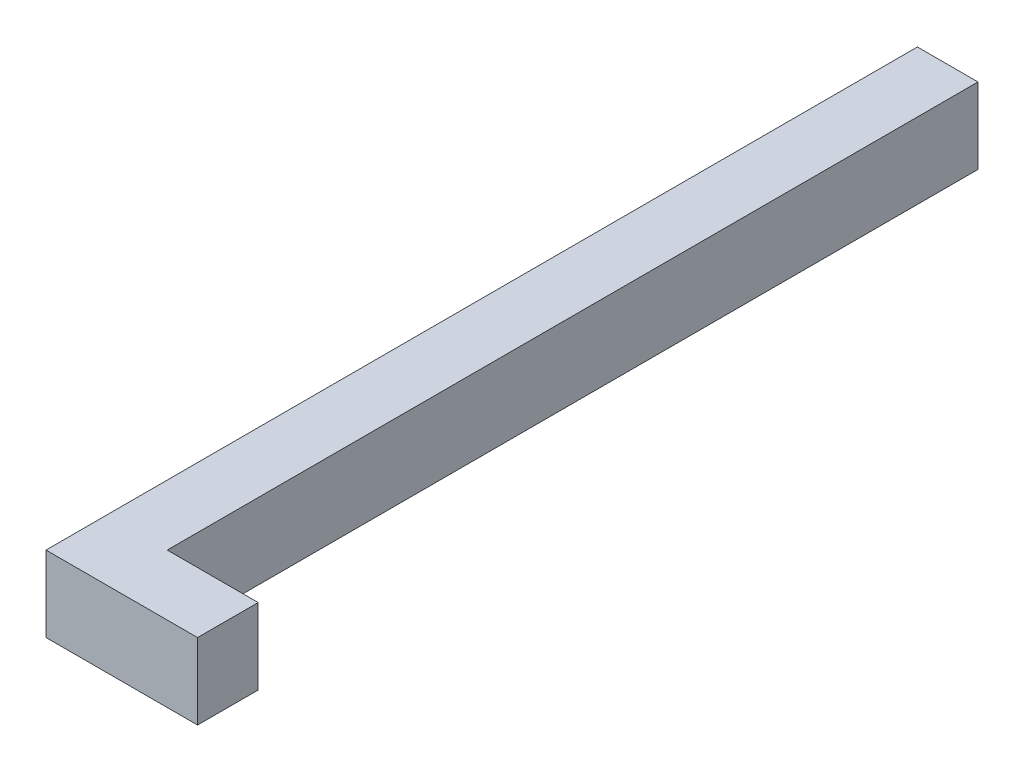
ISO-10303-21;
HEADER;
FILE_DESCRIPTION(('STEP AP214'),'2;1');
FILE_NAME('part.step','',(''),(''),'','','');
FILE_SCHEMA(('AUTOMOTIVE_DESIGN { 1 0 10303 214 1 1 1 1 }'));
ENDSEC;
DATA;
#1=APPLICATION_CONTEXT('core data for automotive mechanical design processes');
#2=APPLICATION_PROTOCOL_DEFINITION('international standard','automotive_design',2000,#1);
#3=PRODUCT_CONTEXT('',#1,'mechanical');
#4=PRODUCT('Part','Part','',(#3));
#5=PRODUCT_RELATED_PRODUCT_CATEGORY('part','',(#4));
#6=PRODUCT_DEFINITION_FORMATION('','',#4);
#7=PRODUCT_DEFINITION_CONTEXT('part definition',#1,'design');
#8=PRODUCT_DEFINITION('design','',#6,#7);
#9=PRODUCT_DEFINITION_SHAPE('','',#8);
#10=(LENGTH_UNIT() NAMED_UNIT(*) SI_UNIT(.MILLI.,.METRE.));
#11=(NAMED_UNIT(*) PLANE_ANGLE_UNIT() SI_UNIT($,.RADIAN.));
#12=(NAMED_UNIT(*) SI_UNIT($,.STERADIAN.) SOLID_ANGLE_UNIT());
#13=UNCERTAINTY_MEASURE_WITH_UNIT(LENGTH_MEASURE(1.E-05),#10,'distance_accuracy_value','');
#14=(GEOMETRIC_REPRESENTATION_CONTEXT(3) GLOBAL_UNCERTAINTY_ASSIGNED_CONTEXT((#13)) GLOBAL_UNIT_ASSIGNED_CONTEXT((#10,
#11,#12)) REPRESENTATION_CONTEXT('',''));
#15=CARTESIAN_POINT('',(0.,0.,0.));
#16=DIRECTION('',(0.,0.,1.));
#17=DIRECTION('',(1.,0.,0.));
#18=AXIS2_PLACEMENT_3D('',#15,#16,#17);
#19=CARTESIAN_POINT('',(8.,0.,115.));
#20=DIRECTION('',(-1.,0.,0.));
#21=DIRECTION('',(0.,0.,1.));
#22=AXIS2_PLACEMENT_3D('',#19,#20,#21);
#23=PLANE('',#22);
#24=DIRECTION('',(0.,1.,0.));
#25=VECTOR('',#24,1.);
#26=CARTESIAN_POINT('',(8.,0.,107.));
#27=LINE('',#26,#25);
#28=CARTESIAN_POINT('',(8.,0.,107.));
#29=VERTEX_POINT('',#28);
#30=CARTESIAN_POINT('',(8.,10.,107.));
#31=VERTEX_POINT('',#30);
#32=EDGE_CURVE('E48',#29,#31,#27,.T.);
#33=ORIENTED_EDGE('',*,*,#32,.F.);
#34=DIRECTION('',(0.,0.,-1.));
#35=VECTOR('',#34,1.);
#36=CARTESIAN_POINT('',(8.,0.,115.));
#37=LINE('',#36,#35);
#38=CARTESIAN_POINT('',(8.,0.,0.));
#39=VERTEX_POINT('',#38);
#40=EDGE_CURVE('E41',#29,#39,#37,.T.);
#41=ORIENTED_EDGE('',*,*,#40,.T.);
#42=DIRECTION('',(0.,1.,0.));
#43=VECTOR('',#42,1.);
#44=CARTESIAN_POINT('',(8.,0.,0.));
#45=LINE('',#44,#43);
#46=CARTESIAN_POINT('',(8.,10.,0.));
#47=VERTEX_POINT('',#46);
#48=EDGE_CURVE('E187',#39,#47,#45,.T.);
#49=ORIENTED_EDGE('',*,*,#48,.T.);
#50=DIRECTION('',(0.,0.,-1.));
#51=VECTOR('',#50,1.);
#52=CARTESIAN_POINT('',(8.,10.,115.));
#53=LINE('',#52,#51);
#54=EDGE_CURVE('E193',#31,#47,#53,.T.);
#55=ORIENTED_EDGE('',*,*,#54,.F.);
#56=EDGE_LOOP('',(#33,#41,#49,#55));
#57=FACE_BOUND('',#56,.T.);
#58=ADVANCED_FACE('F33',(#57),#23,.F.);
#59=CARTESIAN_POINT('',(0.,0.,115.));
#60=DIRECTION('',(1.,0.,0.));
#61=DIRECTION('',(0.,0.,-1.));
#62=AXIS2_PLACEMENT_3D('',#59,#60,#61);
#63=PLANE('',#62);
#64=CARTESIAN_POINT('',(0.,5.,30.));
#65=DIRECTION('',(-1.,0.,0.));
#66=DIRECTION('',(0.,0.,1.));
#67=AXIS2_PLACEMENT_3D('',#64,#65,#66);
#68=CIRCLE('',#67,2.6);
#69=CARTESIAN_POINT('',(0.,5.,32.6));
#70=VERTEX_POINT('',#69);
#71=EDGE_CURVE('E139',#70,#70,#68,.T.);
#72=ORIENTED_EDGE('',*,*,#71,.F.);
#73=EDGE_LOOP('',(#72));
#74=FACE_BOUND('',#73,.T.);
#75=DIRECTION('',(0.,-1.,0.));
#76=VECTOR('',#75,1.);
#77=CARTESIAN_POINT('',(0.,0.,0.));
#78=LINE('',#77,#76);
#79=CARTESIAN_POINT('',(0.,10.,0.));
#80=VERTEX_POINT('',#79);
#81=CARTESIAN_POINT('',(0.,0.,0.));
#82=VERTEX_POINT('',#81);
#83=EDGE_CURVE('E178',#80,#82,#78,.T.);
#84=ORIENTED_EDGE('',*,*,#83,.T.);
#85=DIRECTION('',(0.,0.,-1.));
#86=VECTOR('',#85,1.);
#87=CARTESIAN_POINT('',(0.,0.,115.));
#88=LINE('',#87,#86);
#89=CARTESIAN_POINT('',(0.,0.,115.));
#90=VERTEX_POINT('',#89);
#91=EDGE_CURVE('E11',#90,#82,#88,.T.);
#92=ORIENTED_EDGE('',*,*,#91,.F.);
#93=DIRECTION('',(0.,-1.,0.));
#94=VECTOR('',#93,1.);
#95=CARTESIAN_POINT('',(0.,0.,115.));
#96=LINE('',#95,#94);
#97=CARTESIAN_POINT('',(0.,10.,115.));
#98=VERTEX_POINT('',#97);
#99=EDGE_CURVE('E116',#98,#90,#96,.T.);
#100=ORIENTED_EDGE('',*,*,#99,.F.);
#101=DIRECTION('',(0.,0.,-1.));
#102=VECTOR('',#101,1.);
#103=CARTESIAN_POINT('',(0.,10.,115.));
#104=LINE('',#103,#102);
#105=EDGE_CURVE('E182',#98,#80,#104,.T.);
#106=ORIENTED_EDGE('',*,*,#105,.T.);
#107=EDGE_LOOP('',(#84,#92,#100,#106));
#108=FACE_BOUND('',#107,.T.);
#109=ADVANCED_FACE('F35',(#74,#108),#63,.F.);
#110=CARTESIAN_POINT('',(0.,0.,115.));
#111=DIRECTION('',(0.,1.,0.));
#112=DIRECTION('',(0.,0.,1.));
#113=AXIS2_PLACEMENT_3D('',#110,#111,#112);
#114=PLANE('',#113);
#115=DIRECTION('',(1.,0.,0.));
#116=VECTOR('',#115,1.);
#117=CARTESIAN_POINT('',(0.,0.,0.));
#118=LINE('',#117,#116);
#119=EDGE_CURVE('E185',#82,#39,#118,.T.);
#120=ORIENTED_EDGE('',*,*,#119,.T.);
#121=ORIENTED_EDGE('',*,*,#40,.F.);
#122=DIRECTION('',(-1.,0.,0.));
#123=VECTOR('',#122,1.);
#124=CARTESIAN_POINT('',(20.,0.,107.));
#125=LINE('',#124,#123);
#126=CARTESIAN_POINT('',(20.,0.,107.));
#127=VERTEX_POINT('',#126);
#128=EDGE_CURVE('E126',#127,#29,#125,.T.);
#129=ORIENTED_EDGE('',*,*,#128,.F.);
#130=DIRECTION('',(0.,0.,-1.));
#131=VECTOR('',#130,1.);
#132=CARTESIAN_POINT('',(20.,0.,115.));
#133=LINE('',#132,#131);
#134=CARTESIAN_POINT('',(20.,0.,115.));
#135=VERTEX_POINT('',#134);
#136=EDGE_CURVE('E122',#135,#127,#133,.T.);
#137=ORIENTED_EDGE('',*,*,#136,.F.);
#138=DIRECTION('',(1.,0.,0.));
#139=VECTOR('',#138,1.);
#140=CARTESIAN_POINT('',(0.,0.,115.));
#141=LINE('',#140,#139);
#142=EDGE_CURVE('E110',#90,#135,#141,.T.);
#143=ORIENTED_EDGE('',*,*,#142,.F.);
#144=ORIENTED_EDGE('',*,*,#91,.T.);
#145=EDGE_LOOP('',(#120,#121,#129,#137,#143,#144));
#146=FACE_BOUND('',#145,.T.);
#147=ADVANCED_FACE('F124',(#146),#114,.F.);
#148=CARTESIAN_POINT('',(0.,10.,115.));
#149=DIRECTION('',(0.,-1.,0.));
#150=DIRECTION('',(0.,0.,-1.));
#151=AXIS2_PLACEMENT_3D('',#148,#149,#150);
#152=PLANE('',#151);
#153=DIRECTION('',(-1.,0.,0.));
#154=VECTOR('',#153,1.);
#155=CARTESIAN_POINT('',(0.,10.,0.));
#156=LINE('',#155,#154);
#157=EDGE_CURVE('E179',#47,#80,#156,.T.);
#158=ORIENTED_EDGE('',*,*,#157,.T.);
#159=ORIENTED_EDGE('',*,*,#105,.F.);
#160=DIRECTION('',(-1.,0.,0.));
#161=VECTOR('',#160,1.);
#162=CARTESIAN_POINT('',(0.,10.,115.));
#163=LINE('',#162,#161);
#164=CARTESIAN_POINT('',(20.,10.,115.));
#165=VERTEX_POINT('',#164);
#166=EDGE_CURVE('E119',#165,#98,#163,.T.);
#167=ORIENTED_EDGE('',*,*,#166,.F.);
#168=DIRECTION('',(0.,0.,1.));
#169=VECTOR('',#168,1.);
#170=CARTESIAN_POINT('',(20.,10.,115.));
#171=LINE('',#170,#169);
#172=CARTESIAN_POINT('',(20.,10.,107.));
#173=VERTEX_POINT('',#172);
#174=EDGE_CURVE('E134',#173,#165,#171,.T.);
#175=ORIENTED_EDGE('',*,*,#174,.F.);
#176=DIRECTION('',(-1.,0.,0.));
#177=VECTOR('',#176,1.);
#178=CARTESIAN_POINT('',(20.,10.,107.));
#179=LINE('',#178,#177);
#180=EDGE_CURVE('E143',#173,#31,#179,.T.);
#181=ORIENTED_EDGE('',*,*,#180,.T.);
#182=ORIENTED_EDGE('',*,*,#54,.T.);
#183=EDGE_LOOP('',(#158,#159,#167,#175,#181,#182));
#184=FACE_BOUND('',#183,.T.);
#185=ADVANCED_FACE('F201',(#184),#152,.F.);
#186=CARTESIAN_POINT('',(0.,0.,115.));
#187=DIRECTION('',(0.,0.,-1.));
#188=DIRECTION('',(-1.,0.,0.));
#189=AXIS2_PLACEMENT_3D('',#186,#187,#188);
#190=PLANE('',#189);
#191=ORIENTED_EDGE('',*,*,#99,.T.);
#192=ORIENTED_EDGE('',*,*,#142,.T.);
#193=DIRECTION('',(0.,-1.,0.));
#194=VECTOR('',#193,1.);
#195=CARTESIAN_POINT('',(20.,0.,115.));
#196=LINE('',#195,#194);
#197=EDGE_CURVE('E114',#165,#135,#196,.T.);
#198=ORIENTED_EDGE('',*,*,#197,.F.);
#199=ORIENTED_EDGE('',*,*,#166,.T.);
#200=EDGE_LOOP('',(#191,#192,#198,#199));
#201=FACE_BOUND('',#200,.T.);
#202=ADVANCED_FACE('F112',(#201),#190,.F.);
#203=CARTESIAN_POINT('',(0.,0.,0.));
#204=DIRECTION('',(0.,0.,-1.));
#205=DIRECTION('',(-1.,0.,0.));
#206=AXIS2_PLACEMENT_3D('',#203,#204,#205);
#207=PLANE('',#206);
#208=DIRECTION('',(0.,1.,0.));
#209=VECTOR('',#208,1.);
#210=CARTESIAN_POINT('',(2.1,3.1,0.));
#211=LINE('',#210,#209);
#212=CARTESIAN_POINT('',(2.1,3.1,0.));
#213=VERTEX_POINT('',#212);
#214=CARTESIAN_POINT('',(2.1,6.9,0.));
#215=VERTEX_POINT('',#214);
#216=EDGE_CURVE('E56',#213,#215,#211,.T.);
#217=ORIENTED_EDGE('',*,*,#216,.F.);
#218=DIRECTION('',(-1.,0.,0.));
#219=VECTOR('',#218,1.);
#220=CARTESIAN_POINT('',(5.9,3.1,0.));
#221=LINE('',#220,#219);
#222=CARTESIAN_POINT('',(5.9,3.1,0.));
#223=VERTEX_POINT('',#222);
#224=EDGE_CURVE('E152',#223,#213,#221,.T.);
#225=ORIENTED_EDGE('',*,*,#224,.F.);
#226=DIRECTION('',(0.,-1.,0.));
#227=VECTOR('',#226,1.);
#228=CARTESIAN_POINT('',(5.9,3.1,0.));
#229=LINE('',#228,#227);
#230=CARTESIAN_POINT('',(5.9,6.9,0.));
#231=VERTEX_POINT('',#230);
#232=EDGE_CURVE('E163',#231,#223,#229,.T.);
#233=ORIENTED_EDGE('',*,*,#232,.F.);
#234=DIRECTION('',(1.,0.,0.));
#235=VECTOR('',#234,1.);
#236=CARTESIAN_POINT('',(5.9,6.9,0.));
#237=LINE('',#236,#235);
#238=EDGE_CURVE('E160',#215,#231,#237,.T.);
#239=ORIENTED_EDGE('',*,*,#238,.F.);
#240=EDGE_LOOP('',(#217,#225,#233,#239));
#241=FACE_BOUND('',#240,.T.);
#242=ORIENTED_EDGE('',*,*,#83,.F.);
#243=ORIENTED_EDGE('',*,*,#157,.F.);
#244=ORIENTED_EDGE('',*,*,#48,.F.);
#245=ORIENTED_EDGE('',*,*,#119,.F.);
#246=EDGE_LOOP('',(#242,#243,#244,#245));
#247=FACE_BOUND('',#246,.T.);
#248=ADVANCED_FACE('F198',(#241,#247),#207,.T.);
#249=CARTESIAN_POINT('',(2.1,3.1,-1.8));
#250=DIRECTION('',(1.,0.,0.));
#251=DIRECTION('',(0.,0.,-1.));
#252=AXIS2_PLACEMENT_3D('',#249,#250,#251);
#253=PLANE('',#252);
#254=ORIENTED_EDGE('',*,*,#216,.T.);
#255=DIRECTION('',(0.,0.,1.));
#256=VECTOR('',#255,1.);
#257=CARTESIAN_POINT('',(2.1,6.9,-1.8));
#258=LINE('',#257,#256);
#259=CARTESIAN_POINT('',(2.1,6.9,-1.8));
#260=VERTEX_POINT('',#259);
#261=EDGE_CURVE('E175',#260,#215,#258,.T.);
#262=ORIENTED_EDGE('',*,*,#261,.F.);
#263=DIRECTION('',(0.,1.,0.));
#264=VECTOR('',#263,1.);
#265=CARTESIAN_POINT('',(2.1,3.1,-1.8));
#266=LINE('',#265,#264);
#267=CARTESIAN_POINT('',(2.1,3.1,-1.8));
#268=VERTEX_POINT('',#267);
#269=EDGE_CURVE('E148',#268,#260,#266,.T.);
#270=ORIENTED_EDGE('',*,*,#269,.F.);
#271=DIRECTION('',(0.,0.,1.));
#272=VECTOR('',#271,1.);
#273=CARTESIAN_POINT('',(2.1,3.1,-1.8));
#274=LINE('',#273,#272);
#275=EDGE_CURVE('E158',#268,#213,#274,.T.);
#276=ORIENTED_EDGE('',*,*,#275,.T.);
#277=EDGE_LOOP('',(#254,#262,#270,#276));
#278=FACE_BOUND('',#277,.T.);
#279=ADVANCED_FACE('F248',(#278),#253,.F.);
#280=CARTESIAN_POINT('',(5.9,6.9,-1.8));
#281=DIRECTION('',(0.,-1.,0.));
#282=DIRECTION('',(0.,0.,-1.));
#283=AXIS2_PLACEMENT_3D('',#280,#281,#282);
#284=PLANE('',#283);
#285=ORIENTED_EDGE('',*,*,#238,.T.);
#286=DIRECTION('',(0.,0.,1.));
#287=VECTOR('',#286,1.);
#288=CARTESIAN_POINT('',(5.9,6.9,-1.8));
#289=LINE('',#288,#287);
#290=CARTESIAN_POINT('',(5.9,6.9,-1.8));
#291=VERTEX_POINT('',#290);
#292=EDGE_CURVE('E172',#291,#231,#289,.T.);
#293=ORIENTED_EDGE('',*,*,#292,.F.);
#294=DIRECTION('',(1.,0.,0.));
#295=VECTOR('',#294,1.);
#296=CARTESIAN_POINT('',(5.9,6.9,-1.8));
#297=LINE('',#296,#295);
#298=EDGE_CURVE('E151',#260,#291,#297,.T.);
#299=ORIENTED_EDGE('',*,*,#298,.F.);
#300=ORIENTED_EDGE('',*,*,#261,.T.);
#301=EDGE_LOOP('',(#285,#293,#299,#300));
#302=FACE_BOUND('',#301,.T.);
#303=ADVANCED_FACE('F244',(#302),#284,.F.);
#304=CARTESIAN_POINT('',(5.9,3.1,-1.8));
#305=DIRECTION('',(-1.,0.,0.));
#306=DIRECTION('',(0.,0.,1.));
#307=AXIS2_PLACEMENT_3D('',#304,#305,#306);
#308=PLANE('',#307);
#309=ORIENTED_EDGE('',*,*,#232,.T.);
#310=DIRECTION('',(0.,0.,1.));
#311=VECTOR('',#310,1.);
#312=CARTESIAN_POINT('',(5.9,3.1,-1.8));
#313=LINE('',#312,#311);
#314=CARTESIAN_POINT('',(5.9,3.1,-1.8));
#315=VERTEX_POINT('',#314);
#316=EDGE_CURVE('E169',#315,#223,#313,.T.);
#317=ORIENTED_EDGE('',*,*,#316,.F.);
#318=DIRECTION('',(0.,-1.,0.));
#319=VECTOR('',#318,1.);
#320=CARTESIAN_POINT('',(5.9,3.1,-1.8));
#321=LINE('',#320,#319);
#322=EDGE_CURVE('E154',#291,#315,#321,.T.);
#323=ORIENTED_EDGE('',*,*,#322,.F.);
#324=ORIENTED_EDGE('',*,*,#292,.T.);
#325=EDGE_LOOP('',(#309,#317,#323,#324));
#326=FACE_BOUND('',#325,.T.);
#327=ADVANCED_FACE('F240',(#326),#308,.F.);
#328=CARTESIAN_POINT('',(5.9,3.1,-1.8));
#329=DIRECTION('',(0.,1.,0.));
#330=DIRECTION('',(0.,0.,1.));
#331=AXIS2_PLACEMENT_3D('',#328,#329,#330);
#332=PLANE('',#331);
#333=ORIENTED_EDGE('',*,*,#224,.T.);
#334=ORIENTED_EDGE('',*,*,#275,.F.);
#335=DIRECTION('',(-1.,0.,0.));
#336=VECTOR('',#335,1.);
#337=CARTESIAN_POINT('',(5.9,3.1,-1.8));
#338=LINE('',#337,#336);
#339=EDGE_CURVE('E156',#315,#268,#338,.T.);
#340=ORIENTED_EDGE('',*,*,#339,.F.);
#341=ORIENTED_EDGE('',*,*,#316,.T.);
#342=EDGE_LOOP('',(#333,#334,#340,#341));
#343=FACE_BOUND('',#342,.T.);
#344=ADVANCED_FACE('F236',(#343),#332,.F.);
#345=CARTESIAN_POINT('',(0.,0.,-1.8));
#346=DIRECTION('',(0.,0.,1.));
#347=DIRECTION('',(1.,0.,0.));
#348=AXIS2_PLACEMENT_3D('',#345,#346,#347);
#349=PLANE('',#348);
#350=ORIENTED_EDGE('',*,*,#269,.T.);
#351=ORIENTED_EDGE('',*,*,#298,.T.);
#352=ORIENTED_EDGE('',*,*,#322,.T.);
#353=ORIENTED_EDGE('',*,*,#339,.T.);
#354=EDGE_LOOP('',(#350,#351,#352,#353));
#355=FACE_BOUND('',#354,.T.);
#356=ADVANCED_FACE('F232',(#355),#349,.F.);
#357=CARTESIAN_POINT('',(20.,0.,107.));
#358=DIRECTION('',(0.,0.,1.));
#359=DIRECTION('',(1.,0.,0.));
#360=AXIS2_PLACEMENT_3D('',#357,#358,#359);
#361=PLANE('',#360);
#362=ORIENTED_EDGE('',*,*,#32,.T.);
#363=ORIENTED_EDGE('',*,*,#180,.F.);
#364=DIRECTION('',(0.,1.,0.));
#365=VECTOR('',#364,1.);
#366=CARTESIAN_POINT('',(20.,0.,107.));
#367=LINE('',#366,#365);
#368=EDGE_CURVE('E129',#127,#173,#367,.T.);
#369=ORIENTED_EDGE('',*,*,#368,.F.);
#370=ORIENTED_EDGE('',*,*,#128,.T.);
#371=EDGE_LOOP('',(#362,#363,#369,#370));
#372=FACE_BOUND('',#371,.T.);
#373=ADVANCED_FACE('F227',(#372),#361,.F.);
#374=CARTESIAN_POINT('',(20.,0.,0.));
#375=DIRECTION('',(-1.,0.,0.));
#376=DIRECTION('',(0.,0.,1.));
#377=AXIS2_PLACEMENT_3D('',#374,#375,#376);
#378=PLANE('',#377);
#379=ORIENTED_EDGE('',*,*,#197,.T.);
#380=ORIENTED_EDGE('',*,*,#136,.T.);
#381=ORIENTED_EDGE('',*,*,#368,.T.);
#382=ORIENTED_EDGE('',*,*,#174,.T.);
#383=EDGE_LOOP('',(#379,#380,#381,#382));
#384=FACE_BOUND('',#383,.T.);
#385=ADVANCED_FACE('F132',(#384),#378,.F.);
#386=CARTESIAN_POINT('',(3.,5.,30.));
#387=DIRECTION('',(-1.,0.,0.));
#388=DIRECTION('',(0.,0.,1.));
#389=AXIS2_PLACEMENT_3D('',#386,#387,#388);
#390=CYLINDRICAL_SURFACE('',#389,2.6);
#391=CARTESIAN_POINT('',(3.,5.,30.));
#392=DIRECTION('',(-1.,0.,0.));
#393=DIRECTION('',(0.,0.,1.));
#394=AXIS2_PLACEMENT_3D('',#391,#392,#393);
#395=CIRCLE('',#394,2.6);
#396=CARTESIAN_POINT('',(3.,5.,32.6));
#397=VERTEX_POINT('',#396);
#398=EDGE_CURVE('E136',#397,#397,#395,.T.);
#399=ORIENTED_EDGE('',*,*,#398,.F.);
#400=EDGE_LOOP('',(#399));
#401=FACE_BOUND('',#400,.T.);
#402=ORIENTED_EDGE('',*,*,#71,.T.);
#403=EDGE_LOOP('',(#402));
#404=FACE_BOUND('',#403,.T.);
#405=ADVANCED_FACE('F220',(#401,#404),#390,.F.);
#406=CARTESIAN_POINT('',(3.,5.,30.));
#407=DIRECTION('',(-1.,0.,0.));
#408=DIRECTION('',(0.,0.,1.));
#409=AXIS2_PLACEMENT_3D('',#406,#407,#408);
#410=PLANE('',#409);
#411=ORIENTED_EDGE('',*,*,#398,.T.);
#412=EDGE_LOOP('',(#411));
#413=FACE_BOUND('',#412,.T.);
#414=ADVANCED_FACE('F218',(#413),#410,.T.);
#415=CLOSED_SHELL('',(#58,#109,#147,#185,#202,#248,#279,#303,#327,#344,#356,#373,#385,#405,#414));
#416=MANIFOLD_SOLID_BREP('B2',#415);
#417=ADVANCED_BREP_SHAPE_REPRESENTATION('',(#18,#416),#14);
#418=SHAPE_DEFINITION_REPRESENTATION(#9,#417);
ENDSEC;
END-ISO-10303-21;
